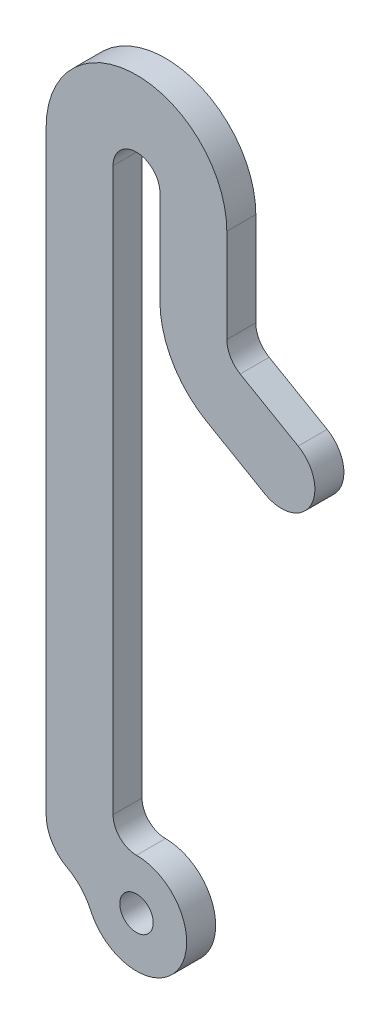
ISO-10303-21;
HEADER;
FILE_DESCRIPTION(('STEP AP214'),'2;1');
FILE_NAME('part.step','',(''),(''),'','','');
FILE_SCHEMA(('AUTOMOTIVE_DESIGN { 1 0 10303 214 1 1 1 1 }'));
ENDSEC;
DATA;
#1=APPLICATION_CONTEXT('core data for automotive mechanical design processes');
#2=APPLICATION_PROTOCOL_DEFINITION('international standard','automotive_design',2000,#1);
#3=PRODUCT_CONTEXT('',#1,'mechanical');
#4=PRODUCT('Part','Part','',(#3));
#5=PRODUCT_RELATED_PRODUCT_CATEGORY('part','',(#4));
#6=PRODUCT_DEFINITION_FORMATION('','',#4);
#7=PRODUCT_DEFINITION_CONTEXT('part definition',#1,'design');
#8=PRODUCT_DEFINITION('design','',#6,#7);
#9=PRODUCT_DEFINITION_SHAPE('','',#8);
#10=(LENGTH_UNIT() NAMED_UNIT(*) SI_UNIT(.MILLI.,.METRE.));
#11=(NAMED_UNIT(*) PLANE_ANGLE_UNIT() SI_UNIT($,.RADIAN.));
#12=(NAMED_UNIT(*) SI_UNIT($,.STERADIAN.) SOLID_ANGLE_UNIT());
#13=UNCERTAINTY_MEASURE_WITH_UNIT(LENGTH_MEASURE(1.E-05),#10,'distance_accuracy_value','');
#14=(GEOMETRIC_REPRESENTATION_CONTEXT(3) GLOBAL_UNCERTAINTY_ASSIGNED_CONTEXT((#13)) GLOBAL_UNIT_ASSIGNED_CONTEXT((#10,
#11,#12)) REPRESENTATION_CONTEXT('',''));
#15=CARTESIAN_POINT('',(0.,0.,0.));
#16=DIRECTION('',(0.,0.,1.));
#17=DIRECTION('',(1.,0.,0.));
#18=AXIS2_PLACEMENT_3D('',#15,#16,#17);
#19=CARTESIAN_POINT('',(0.,0.,5.503333164));
#20=DIRECTION('',(0.,0.,1.));
#21=DIRECTION('',(1.,0.,0.));
#22=AXIS2_PLACEMENT_3D('',#19,#20,#21);
#23=PLANE('',#22);
#24=CARTESIAN_POINT('',(0.,0.,5.503333164));
#25=DIRECTION('',(0.,0.,1.));
#26=DIRECTION('',(1.,0.,0.));
#27=AXIS2_PLACEMENT_3D('',#24,#25,#26);
#28=CIRCLE('',#27,3.175);
#29=CARTESIAN_POINT('',(3.175,0.,5.503333164));
#30=VERTEX_POINT('',#29);
#31=EDGE_CURVE('E46',#30,#30,#28,.T.);
#32=ORIENTED_EDGE('',*,*,#31,.T.);
#33=EDGE_LOOP('',(#32));
#34=FACE_BOUND('',#33,.T.);
#35=CARTESIAN_POINT('',(0.,0.,5.503333164));
#36=DIRECTION('',(0.,0.,1.));
#37=DIRECTION('',(1.,0.,0.));
#38=AXIS2_PLACEMENT_3D('',#35,#36,#37);
#39=CIRCLE('',#38,9.525);
#40=CARTESIAN_POINT('',(-8.69790974925393,-3.88226621882548,5.503333164));
#41=VERTEX_POINT('',#40);
#42=CARTESIAN_POINT('',(0.,9.525,5.503333164));
#43=VERTEX_POINT('',#42);
#44=EDGE_CURVE('E154',#41,#43,#39,.T.);
#45=ORIENTED_EDGE('',*,*,#44,.F.);
#46=CARTESIAN_POINT('',(-17.9756801484581,-8.02335018557265,5.503333164));
#47=DIRECTION('',(0.,0.,1.));
#48=DIRECTION('',(1.,0.,0.));
#49=AXIS2_PLACEMENT_3D('',#46,#47,#48);
#50=CIRCLE('',#49,10.16);
#51=CARTESIAN_POINT('',(-13.1467200636249,0.915707063326008,5.503333164));
#52=VERTEX_POINT('',#51);
#53=EDGE_CURVE('E157',#52,#41,#50,.F.);
#54=ORIENTED_EDGE('',*,*,#53,.F.);
#55=CARTESIAN_POINT('',(-9.525,7.61999999999999,5.503333164));
#56=DIRECTION('',(0.,0.,1.));
#57=DIRECTION('',(1.,0.,0.));
#58=AXIS2_PLACEMENT_3D('',#55,#56,#57);
#59=CIRCLE('',#58,7.61999999999999);
#60=CARTESIAN_POINT('',(-17.145,7.61999999999999,5.503333164));
#61=VERTEX_POINT('',#60);
#62=EDGE_CURVE('E147',#61,#52,#59,.T.);
#63=ORIENTED_EDGE('',*,*,#62,.F.);
#64=DIRECTION('',(0.,-1.,0.));
#65=VECTOR('',#64,1.);
#66=CARTESIAN_POINT('',(-17.145,120.65,5.503333164));
#67=LINE('',#66,#65);
#68=CARTESIAN_POINT('',(-17.145,120.65,5.503333164));
#69=VERTEX_POINT('',#68);
#70=EDGE_CURVE('E168',#69,#61,#67,.T.);
#71=ORIENTED_EDGE('',*,*,#70,.F.);
#72=CARTESIAN_POINT('',(0.,120.65,5.503333164));
#73=DIRECTION('',(0.,0.,1.));
#74=DIRECTION('',(1.,0.,0.));
#75=AXIS2_PLACEMENT_3D('',#72,#73,#74);
#76=CIRCLE('',#75,17.145);
#77=CARTESIAN_POINT('',(17.145,120.65,5.503333164));
#78=VERTEX_POINT('',#77);
#79=EDGE_CURVE('E170',#78,#69,#76,.T.);
#80=ORIENTED_EDGE('',*,*,#79,.F.);
#81=DIRECTION('',(0.,1.,0.));
#82=VECTOR('',#81,1.);
#83=CARTESIAN_POINT('',(17.145,120.65,5.503333164));
#84=LINE('',#83,#82);
#85=CARTESIAN_POINT('',(17.145,102.87,5.503333164));
#86=VERTEX_POINT('',#85);
#87=EDGE_CURVE('E172',#86,#78,#84,.T.);
#88=ORIENTED_EDGE('',*,*,#87,.F.);
#89=CARTESIAN_POINT('',(22.225,102.87,5.503333164));
#90=DIRECTION('',(0.,0.,1.));
#91=DIRECTION('',(1.,0.,0.));
#92=AXIS2_PLACEMENT_3D('',#89,#90,#91);
#93=CIRCLE('',#92,5.08);
#94=CARTESIAN_POINT('',(19.685,98.470590948775,5.503333164));
#95=VERTEX_POINT('',#94);
#96=EDGE_CURVE('E174',#95,#86,#93,.F.);
#97=ORIENTED_EDGE('',*,*,#96,.F.);
#98=DIRECTION('',(-0.86602540378444,0.499999999999997,0.));
#99=VECTOR('',#98,1.);
#100=CARTESIAN_POINT('',(19.685,98.470590948775,5.503333164));
#101=LINE('',#100,#99);
#102=CARTESIAN_POINT('',(30.6835226280626,92.1205909487749,5.503333164));
#103=VERTEX_POINT('',#102);
#104=EDGE_CURVE('E176',#103,#95,#101,.T.);
#105=ORIENTED_EDGE('',*,*,#104,.F.);
#106=CARTESIAN_POINT('',(27.5085226280626,86.6213296347437,5.503333164));
#107=DIRECTION('',(0.,0.,1.));
#108=DIRECTION('',(1.,0.,0.));
#109=AXIS2_PLACEMENT_3D('',#106,#107,#108);
#110=CIRCLE('',#109,6.34999999999999);
#111=CARTESIAN_POINT('',(24.3335226280625,81.1220683207127,5.503333164));
#112=VERTEX_POINT('',#111);
#113=EDGE_CURVE('E178',#112,#103,#110,.T.);
#114=ORIENTED_EDGE('',*,*,#113,.F.);
#115=DIRECTION('',(0.86602540378444,-0.499999999999997,0.));
#116=VECTOR('',#115,1.);
#117=CARTESIAN_POINT('',(24.3335226280625,81.1220683207127,5.503333164));
#118=LINE('',#117,#116);
#119=CARTESIAN_POINT('',(13.335,87.4720683207127,5.503333164));
#120=VERTEX_POINT('',#119);
#121=EDGE_CURVE('E180',#120,#112,#118,.T.);
#122=ORIENTED_EDGE('',*,*,#121,.F.);
#123=CARTESIAN_POINT('',(22.225,102.87,5.503333164));
#124=DIRECTION('',(0.,0.,1.));
#125=DIRECTION('',(1.,0.,0.));
#126=AXIS2_PLACEMENT_3D('',#123,#124,#125);
#127=CIRCLE('',#126,17.78);
#128=CARTESIAN_POINT('',(4.445,102.87,5.503333164));
#129=VERTEX_POINT('',#128);
#130=EDGE_CURVE('E182',#129,#120,#127,.T.);
#131=ORIENTED_EDGE('',*,*,#130,.F.);
#132=DIRECTION('',(0.,-1.,0.));
#133=VECTOR('',#132,1.);
#134=CARTESIAN_POINT('',(4.445,120.65,5.503333164));
#135=LINE('',#134,#133);
#136=CARTESIAN_POINT('',(4.445,120.65,5.503333164));
#137=VERTEX_POINT('',#136);
#138=EDGE_CURVE('E184',#137,#129,#135,.T.);
#139=ORIENTED_EDGE('',*,*,#138,.F.);
#140=CARTESIAN_POINT('',(0.,120.65,5.503333164));
#141=DIRECTION('',(0.,0.,1.));
#142=DIRECTION('',(1.,0.,0.));
#143=AXIS2_PLACEMENT_3D('',#140,#141,#142);
#144=CIRCLE('',#143,4.445);
#145=CARTESIAN_POINT('',(-4.445,120.65,5.503333164));
#146=VERTEX_POINT('',#145);
#147=EDGE_CURVE('E186',#146,#137,#144,.F.);
#148=ORIENTED_EDGE('',*,*,#147,.F.);
#149=DIRECTION('',(0.,1.,0.));
#150=VECTOR('',#149,1.);
#151=CARTESIAN_POINT('',(-4.445,120.65,5.503333164));
#152=LINE('',#151,#150);
#153=CARTESIAN_POINT('',(-4.445,13.97,5.503333164));
#154=VERTEX_POINT('',#153);
#155=EDGE_CURVE('E188',#154,#146,#152,.T.);
#156=ORIENTED_EDGE('',*,*,#155,.F.);
#157=CARTESIAN_POINT('',(0.,13.97,5.503333164));
#158=DIRECTION('',(0.,0.,1.));
#159=DIRECTION('',(1.,0.,0.));
#160=AXIS2_PLACEMENT_3D('',#157,#158,#159);
#161=CIRCLE('',#160,4.445);
#162=EDGE_CURVE('E166',#43,#154,#161,.F.);
#163=ORIENTED_EDGE('',*,*,#162,.F.);
#164=EDGE_LOOP('',(#45,#54,#63,#71,#80,#88,#97,#105,#114,#122,#131,#139,#148,#156,#163));
#165=FACE_BOUND('',#164,.T.);
#166=ADVANCED_FACE('F38',(#34,#165),#23,.F.);
#167=CARTESIAN_POINT('',(0.,0.,11.006666582));
#168=DIRECTION('',(0.,0.,1.));
#169=DIRECTION('',(1.,0.,0.));
#170=AXIS2_PLACEMENT_3D('',#167,#168,#169);
#171=PLANE('',#170);
#172=CARTESIAN_POINT('',(0.,0.,11.006666582));
#173=DIRECTION('',(0.,0.,1.));
#174=DIRECTION('',(1.,0.,0.));
#175=AXIS2_PLACEMENT_3D('',#172,#173,#174);
#176=CIRCLE('',#175,9.525);
#177=CARTESIAN_POINT('',(-8.69790974925393,-3.88226621882548,11.006666582));
#178=VERTEX_POINT('',#177);
#179=CARTESIAN_POINT('',(0.,9.525,11.006666582));
#180=VERTEX_POINT('',#179);
#181=EDGE_CURVE('E194',#178,#180,#176,.T.);
#182=ORIENTED_EDGE('',*,*,#181,.T.);
#183=CARTESIAN_POINT('',(0.,13.97,11.006666582));
#184=DIRECTION('',(0.,0.,1.));
#185=DIRECTION('',(1.,0.,0.));
#186=AXIS2_PLACEMENT_3D('',#183,#184,#185);
#187=CIRCLE('',#186,4.445);
#188=CARTESIAN_POINT('',(-4.445,13.97,11.006666582));
#189=VERTEX_POINT('',#188);
#190=EDGE_CURVE('E197',#180,#189,#187,.F.);
#191=ORIENTED_EDGE('',*,*,#190,.T.);
#192=DIRECTION('',(0.,1.,0.));
#193=VECTOR('',#192,1.);
#194=CARTESIAN_POINT('',(-4.445,120.65,11.006666582));
#195=LINE('',#194,#193);
#196=CARTESIAN_POINT('',(-4.445,120.65,11.006666582));
#197=VERTEX_POINT('',#196);
#198=EDGE_CURVE('E228',#189,#197,#195,.T.);
#199=ORIENTED_EDGE('',*,*,#198,.T.);
#200=CARTESIAN_POINT('',(0.,120.65,11.006666582));
#201=DIRECTION('',(0.,0.,1.));
#202=DIRECTION('',(1.,0.,0.));
#203=AXIS2_PLACEMENT_3D('',#200,#201,#202);
#204=CIRCLE('',#203,4.445);
#205=CARTESIAN_POINT('',(4.445,120.65,11.006666582));
#206=VERTEX_POINT('',#205);
#207=EDGE_CURVE('E225',#197,#206,#204,.F.);
#208=ORIENTED_EDGE('',*,*,#207,.T.);
#209=DIRECTION('',(0.,-1.,0.));
#210=VECTOR('',#209,1.);
#211=CARTESIAN_POINT('',(4.445,120.65,11.006666582));
#212=LINE('',#211,#210);
#213=CARTESIAN_POINT('',(4.445,102.87,11.006666582));
#214=VERTEX_POINT('',#213);
#215=EDGE_CURVE('E222',#206,#214,#212,.T.);
#216=ORIENTED_EDGE('',*,*,#215,.T.);
#217=CARTESIAN_POINT('',(22.225,102.87,11.006666582));
#218=DIRECTION('',(0.,0.,1.));
#219=DIRECTION('',(1.,0.,0.));
#220=AXIS2_PLACEMENT_3D('',#217,#218,#219);
#221=CIRCLE('',#220,17.78);
#222=CARTESIAN_POINT('',(13.335,87.4720683207127,11.006666582));
#223=VERTEX_POINT('',#222);
#224=EDGE_CURVE('E219',#214,#223,#221,.T.);
#225=ORIENTED_EDGE('',*,*,#224,.T.);
#226=DIRECTION('',(0.86602540378444,-0.499999999999997,0.));
#227=VECTOR('',#226,1.);
#228=CARTESIAN_POINT('',(24.3335226280625,81.1220683207127,11.006666582));
#229=LINE('',#228,#227);
#230=CARTESIAN_POINT('',(24.3335226280625,81.1220683207127,11.006666582));
#231=VERTEX_POINT('',#230);
#232=EDGE_CURVE('E216',#223,#231,#229,.T.);
#233=ORIENTED_EDGE('',*,*,#232,.T.);
#234=CARTESIAN_POINT('',(27.5085226280626,86.6213296347437,11.006666582));
#235=DIRECTION('',(0.,0.,1.));
#236=DIRECTION('',(1.,0.,0.));
#237=AXIS2_PLACEMENT_3D('',#234,#235,#236);
#238=CIRCLE('',#237,6.34999999999999);
#239=CARTESIAN_POINT('',(30.6835226280626,92.1205909487749,11.006666582));
#240=VERTEX_POINT('',#239);
#241=EDGE_CURVE('E213',#231,#240,#238,.T.);
#242=ORIENTED_EDGE('',*,*,#241,.T.);
#243=DIRECTION('',(-0.86602540378444,0.499999999999997,0.));
#244=VECTOR('',#243,1.);
#245=CARTESIAN_POINT('',(19.685,98.470590948775,11.006666582));
#246=LINE('',#245,#244);
#247=CARTESIAN_POINT('',(19.685,98.470590948775,11.006666582));
#248=VERTEX_POINT('',#247);
#249=EDGE_CURVE('E210',#240,#248,#246,.T.);
#250=ORIENTED_EDGE('',*,*,#249,.T.);
#251=CARTESIAN_POINT('',(22.225,102.87,11.006666582));
#252=DIRECTION('',(0.,0.,1.));
#253=DIRECTION('',(1.,0.,0.));
#254=AXIS2_PLACEMENT_3D('',#251,#252,#253);
#255=CIRCLE('',#254,5.08);
#256=CARTESIAN_POINT('',(17.145,102.87,11.006666582));
#257=VERTEX_POINT('',#256);
#258=EDGE_CURVE('E207',#248,#257,#255,.F.);
#259=ORIENTED_EDGE('',*,*,#258,.T.);
#260=DIRECTION('',(0.,1.,0.));
#261=VECTOR('',#260,1.);
#262=CARTESIAN_POINT('',(17.145,120.65,11.006666582));
#263=LINE('',#262,#261);
#264=CARTESIAN_POINT('',(17.145,120.65,11.006666582));
#265=VERTEX_POINT('',#264);
#266=EDGE_CURVE('E204',#257,#265,#263,.T.);
#267=ORIENTED_EDGE('',*,*,#266,.T.);
#268=CARTESIAN_POINT('',(0.,120.65,11.006666582));
#269=DIRECTION('',(0.,0.,1.));
#270=DIRECTION('',(1.,0.,0.));
#271=AXIS2_PLACEMENT_3D('',#268,#269,#270);
#272=CIRCLE('',#271,17.145);
#273=CARTESIAN_POINT('',(-17.145,120.65,11.006666582));
#274=VERTEX_POINT('',#273);
#275=EDGE_CURVE('E201',#265,#274,#272,.T.);
#276=ORIENTED_EDGE('',*,*,#275,.T.);
#277=DIRECTION('',(0.,-1.,0.));
#278=VECTOR('',#277,1.);
#279=CARTESIAN_POINT('',(-17.145,120.65,11.006666582));
#280=LINE('',#279,#278);
#281=CARTESIAN_POINT('',(-17.145,7.61999999999999,11.006666582));
#282=VERTEX_POINT('',#281);
#283=EDGE_CURVE('E193',#274,#282,#280,.T.);
#284=ORIENTED_EDGE('',*,*,#283,.T.);
#285=CARTESIAN_POINT('',(-9.525,7.61999999999999,11.006666582));
#286=DIRECTION('',(0.,0.,1.));
#287=DIRECTION('',(1.,0.,0.));
#288=AXIS2_PLACEMENT_3D('',#285,#286,#287);
#289=CIRCLE('',#288,7.61999999999999);
#290=CARTESIAN_POINT('',(-13.1467200636249,0.915707063326008,11.006666582));
#291=VERTEX_POINT('',#290);
#292=EDGE_CURVE('E153',#282,#291,#289,.T.);
#293=ORIENTED_EDGE('',*,*,#292,.T.);
#294=CARTESIAN_POINT('',(-17.9756801484581,-8.02335018557265,11.006666582));
#295=DIRECTION('',(0.,0.,1.));
#296=DIRECTION('',(1.,0.,0.));
#297=AXIS2_PLACEMENT_3D('',#294,#295,#296);
#298=CIRCLE('',#297,10.16);
#299=EDGE_CURVE('E11',#291,#178,#298,.F.);
#300=ORIENTED_EDGE('',*,*,#299,.T.);
#301=EDGE_LOOP('',(#182,#191,#199,#208,#216,#225,#233,#242,#250,#259,#267,#276,#284,#293,#300));
#302=FACE_BOUND('',#301,.T.);
#303=CARTESIAN_POINT('',(0.,0.,11.006666582));
#304=DIRECTION('',(0.,0.,1.));
#305=DIRECTION('',(1.,0.,0.));
#306=AXIS2_PLACEMENT_3D('',#303,#304,#305);
#307=CIRCLE('',#306,3.175);
#308=CARTESIAN_POINT('',(3.175,0.,11.006666582));
#309=VERTEX_POINT('',#308);
#310=EDGE_CURVE('E41',#309,#309,#307,.T.);
#311=ORIENTED_EDGE('',*,*,#310,.F.);
#312=EDGE_LOOP('',(#311));
#313=FACE_BOUND('',#312,.T.);
#314=ADVANCED_FACE('F234',(#302,#313),#171,.T.);
#315=CARTESIAN_POINT('',(0.,13.97,16.51));
#316=DIRECTION('',(0.,0.,-1.));
#317=DIRECTION('',(-1.,0.,0.));
#318=AXIS2_PLACEMENT_3D('',#315,#316,#317);
#319=CYLINDRICAL_SURFACE('',#318,4.445);
#320=ORIENTED_EDGE('',*,*,#190,.F.);
#321=DIRECTION('',(0.,0.,-1.));
#322=VECTOR('',#321,1.);
#323=CARTESIAN_POINT('',(0.,9.525,16.51));
#324=LINE('',#323,#322);
#325=EDGE_CURVE('E162',#180,#43,#324,.T.);
#326=ORIENTED_EDGE('',*,*,#325,.T.);
#327=ORIENTED_EDGE('',*,*,#162,.T.);
#328=DIRECTION('',(0.,0.,-1.));
#329=VECTOR('',#328,1.);
#330=CARTESIAN_POINT('',(-4.445,13.97,16.51));
#331=LINE('',#330,#329);
#332=EDGE_CURVE('E242',#189,#154,#331,.T.);
#333=ORIENTED_EDGE('',*,*,#332,.F.);
#334=EDGE_LOOP('',(#320,#326,#327,#333));
#335=FACE_BOUND('',#334,.T.);
#336=ADVANCED_FACE('F255',(#335),#319,.F.);
#337=CARTESIAN_POINT('',(-4.445,120.65,16.51));
#338=DIRECTION('',(-1.,0.,0.));
#339=DIRECTION('',(0.,0.,1.));
#340=AXIS2_PLACEMENT_3D('',#337,#338,#339);
#341=PLANE('',#340);
#342=ORIENTED_EDGE('',*,*,#198,.F.);
#343=ORIENTED_EDGE('',*,*,#332,.T.);
#344=ORIENTED_EDGE('',*,*,#155,.T.);
#345=DIRECTION('',(0.,0.,-1.));
#346=VECTOR('',#345,1.);
#347=CARTESIAN_POINT('',(-4.445,120.65,16.51));
#348=LINE('',#347,#346);
#349=EDGE_CURVE('E244',#197,#146,#348,.T.);
#350=ORIENTED_EDGE('',*,*,#349,.F.);
#351=EDGE_LOOP('',(#342,#343,#344,#350));
#352=FACE_BOUND('',#351,.T.);
#353=ADVANCED_FACE('F241',(#352),#341,.F.);
#354=CARTESIAN_POINT('',(0.,120.65,16.51));
#355=DIRECTION('',(0.,0.,-1.));
#356=DIRECTION('',(-1.,0.,0.));
#357=AXIS2_PLACEMENT_3D('',#354,#355,#356);
#358=CYLINDRICAL_SURFACE('',#357,4.445);
#359=ORIENTED_EDGE('',*,*,#207,.F.);
#360=ORIENTED_EDGE('',*,*,#349,.T.);
#361=ORIENTED_EDGE('',*,*,#147,.T.);
#362=DIRECTION('',(0.,0.,-1.));
#363=VECTOR('',#362,1.);
#364=CARTESIAN_POINT('',(4.445,120.65,16.51));
#365=LINE('',#364,#363);
#366=EDGE_CURVE('E248',#206,#137,#365,.T.);
#367=ORIENTED_EDGE('',*,*,#366,.F.);
#368=EDGE_LOOP('',(#359,#360,#361,#367));
#369=FACE_BOUND('',#368,.T.);
#370=ADVANCED_FACE('F295',(#369),#358,.F.);
#371=CARTESIAN_POINT('',(4.445,120.65,16.51));
#372=DIRECTION('',(1.,0.,0.));
#373=DIRECTION('',(0.,1.,0.));
#374=AXIS2_PLACEMENT_3D('',#371,#372,#373);
#375=PLANE('',#374);
#376=ORIENTED_EDGE('',*,*,#215,.F.);
#377=ORIENTED_EDGE('',*,*,#366,.T.);
#378=ORIENTED_EDGE('',*,*,#138,.T.);
#379=DIRECTION('',(0.,0.,-1.));
#380=VECTOR('',#379,1.);
#381=CARTESIAN_POINT('',(4.445,102.87,16.51));
#382=LINE('',#381,#380);
#383=EDGE_CURVE('E252',#214,#129,#382,.T.);
#384=ORIENTED_EDGE('',*,*,#383,.F.);
#385=EDGE_LOOP('',(#376,#377,#378,#384));
#386=FACE_BOUND('',#385,.T.);
#387=ADVANCED_FACE('F292',(#386),#375,.F.);
#388=CARTESIAN_POINT('',(22.225,102.87,16.51));
#389=DIRECTION('',(0.,0.,-1.));
#390=DIRECTION('',(-1.,0.,0.));
#391=AXIS2_PLACEMENT_3D('',#388,#389,#390);
#392=CYLINDRICAL_SURFACE('',#391,17.78);
#393=ORIENTED_EDGE('',*,*,#224,.F.);
#394=ORIENTED_EDGE('',*,*,#383,.T.);
#395=ORIENTED_EDGE('',*,*,#130,.T.);
#396=DIRECTION('',(0.,0.,-1.));
#397=VECTOR('',#396,1.);
#398=CARTESIAN_POINT('',(13.335,87.4720683207127,16.51));
#399=LINE('',#398,#397);
#400=EDGE_CURVE('E282',#223,#120,#399,.T.);
#401=ORIENTED_EDGE('',*,*,#400,.F.);
#402=EDGE_LOOP('',(#393,#394,#395,#401));
#403=FACE_BOUND('',#402,.T.);
#404=ADVANCED_FACE('F287',(#403),#392,.T.);
#405=CARTESIAN_POINT('',(24.3335226280625,81.1220683207127,16.51));
#406=DIRECTION('',(0.499999999999997,0.86602540378444,0.));
#407=DIRECTION('',(-0.86602540378444,0.499999999999997,0.));
#408=AXIS2_PLACEMENT_3D('',#405,#406,#407);
#409=PLANE('',#408);
#410=ORIENTED_EDGE('',*,*,#232,.F.);
#411=ORIENTED_EDGE('',*,*,#400,.T.);
#412=ORIENTED_EDGE('',*,*,#121,.T.);
#413=DIRECTION('',(0.,0.,-1.));
#414=VECTOR('',#413,1.);
#415=CARTESIAN_POINT('',(24.3335226280625,81.1220683207127,16.51));
#416=LINE('',#415,#414);
#417=EDGE_CURVE('E279',#231,#112,#416,.T.);
#418=ORIENTED_EDGE('',*,*,#417,.F.);
#419=EDGE_LOOP('',(#410,#411,#412,#418));
#420=FACE_BOUND('',#419,.T.);
#421=ADVANCED_FACE('F299',(#420),#409,.F.);
#422=CARTESIAN_POINT('',(27.5085226280626,86.6213296347437,16.51));
#423=DIRECTION('',(0.,0.,-1.));
#424=DIRECTION('',(-1.,0.,0.));
#425=AXIS2_PLACEMENT_3D('',#422,#423,#424);
#426=CYLINDRICAL_SURFACE('',#425,6.34999999999999);
#427=ORIENTED_EDGE('',*,*,#241,.F.);
#428=ORIENTED_EDGE('',*,*,#417,.T.);
#429=ORIENTED_EDGE('',*,*,#113,.T.);
#430=DIRECTION('',(0.,0.,-1.));
#431=VECTOR('',#430,1.);
#432=CARTESIAN_POINT('',(30.6835226280626,92.1205909487749,16.51));
#433=LINE('',#432,#431);
#434=EDGE_CURVE('E276',#240,#103,#433,.T.);
#435=ORIENTED_EDGE('',*,*,#434,.F.);
#436=EDGE_LOOP('',(#427,#428,#429,#435));
#437=FACE_BOUND('',#436,.T.);
#438=ADVANCED_FACE('F303',(#437),#426,.T.);
#439=CARTESIAN_POINT('',(19.685,98.470590948775,16.51));
#440=DIRECTION('',(-0.499999999999997,-0.86602540378444,0.));
#441=DIRECTION('',(0.86602540378444,-0.499999999999997,0.));
#442=AXIS2_PLACEMENT_3D('',#439,#440,#441);
#443=PLANE('',#442);
#444=ORIENTED_EDGE('',*,*,#249,.F.);
#445=ORIENTED_EDGE('',*,*,#434,.T.);
#446=ORIENTED_EDGE('',*,*,#104,.T.);
#447=DIRECTION('',(0.,0.,-1.));
#448=VECTOR('',#447,1.);
#449=CARTESIAN_POINT('',(19.685,98.470590948775,16.51));
#450=LINE('',#449,#448);
#451=EDGE_CURVE('E273',#248,#95,#450,.T.);
#452=ORIENTED_EDGE('',*,*,#451,.F.);
#453=EDGE_LOOP('',(#444,#445,#446,#452));
#454=FACE_BOUND('',#453,.T.);
#455=ADVANCED_FACE('F305',(#454),#443,.F.);
#456=CARTESIAN_POINT('',(22.225,102.87,16.51));
#457=DIRECTION('',(0.,0.,-1.));
#458=DIRECTION('',(-1.,0.,0.));
#459=AXIS2_PLACEMENT_3D('',#456,#457,#458);
#460=CYLINDRICAL_SURFACE('',#459,5.08);
#461=ORIENTED_EDGE('',*,*,#258,.F.);
#462=ORIENTED_EDGE('',*,*,#451,.T.);
#463=ORIENTED_EDGE('',*,*,#96,.T.);
#464=DIRECTION('',(0.,0.,-1.));
#465=VECTOR('',#464,1.);
#466=CARTESIAN_POINT('',(17.145,102.87,16.51));
#467=LINE('',#466,#465);
#468=EDGE_CURVE('E270',#257,#86,#467,.T.);
#469=ORIENTED_EDGE('',*,*,#468,.F.);
#470=EDGE_LOOP('',(#461,#462,#463,#469));
#471=FACE_BOUND('',#470,.T.);
#472=ADVANCED_FACE('F310',(#471),#460,.F.);
#473=CARTESIAN_POINT('',(17.145,120.65,16.51));
#474=DIRECTION('',(-1.,0.,0.));
#475=DIRECTION('',(0.,-1.,0.));
#476=AXIS2_PLACEMENT_3D('',#473,#474,#475);
#477=PLANE('',#476);
#478=ORIENTED_EDGE('',*,*,#266,.F.);
#479=ORIENTED_EDGE('',*,*,#468,.T.);
#480=ORIENTED_EDGE('',*,*,#87,.T.);
#481=DIRECTION('',(0.,0.,-1.));
#482=VECTOR('',#481,1.);
#483=CARTESIAN_POINT('',(17.145,120.65,16.51));
#484=LINE('',#483,#482);
#485=EDGE_CURVE('E265',#265,#78,#484,.T.);
#486=ORIENTED_EDGE('',*,*,#485,.F.);
#487=EDGE_LOOP('',(#478,#479,#480,#486));
#488=FACE_BOUND('',#487,.T.);
#489=ADVANCED_FACE('F313',(#488),#477,.F.);
#490=CARTESIAN_POINT('',(0.,0.,16.51));
#491=DIRECTION('',(0.,0.,-1.));
#492=DIRECTION('',(-1.,0.,0.));
#493=AXIS2_PLACEMENT_3D('',#490,#491,#492);
#494=CYLINDRICAL_SURFACE('',#493,9.525);
#495=ORIENTED_EDGE('',*,*,#181,.F.);
#496=DIRECTION('',(0.,0.,-1.));
#497=VECTOR('',#496,1.);
#498=CARTESIAN_POINT('',(-8.69790974925393,-3.88226621882548,16.51));
#499=LINE('',#498,#497);
#500=EDGE_CURVE('E62',#178,#41,#499,.T.);
#501=ORIENTED_EDGE('',*,*,#500,.T.);
#502=ORIENTED_EDGE('',*,*,#44,.T.);
#503=ORIENTED_EDGE('',*,*,#325,.F.);
#504=EDGE_LOOP('',(#495,#501,#502,#503));
#505=FACE_BOUND('',#504,.T.);
#506=ADVANCED_FACE('F257',(#505),#494,.T.);
#507=CARTESIAN_POINT('',(-9.525,7.61999999999999,16.51));
#508=DIRECTION('',(0.,0.,-1.));
#509=DIRECTION('',(-1.,0.,0.));
#510=AXIS2_PLACEMENT_3D('',#507,#508,#509);
#511=CYLINDRICAL_SURFACE('',#510,7.61999999999999);
#512=ORIENTED_EDGE('',*,*,#292,.F.);
#513=DIRECTION('',(0.,0.,-1.));
#514=VECTOR('',#513,1.);
#515=CARTESIAN_POINT('',(-17.145,7.61999999999999,16.51));
#516=LINE('',#515,#514);
#517=EDGE_CURVE('E150',#282,#61,#516,.T.);
#518=ORIENTED_EDGE('',*,*,#517,.T.);
#519=ORIENTED_EDGE('',*,*,#62,.T.);
#520=DIRECTION('',(0.,0.,-1.));
#521=VECTOR('',#520,1.);
#522=CARTESIAN_POINT('',(-13.1467200636249,0.915707063326008,16.51));
#523=LINE('',#522,#521);
#524=EDGE_CURVE('E54',#52,#291,#523,.F.);
#525=ORIENTED_EDGE('',*,*,#524,.T.);
#526=EDGE_LOOP('',(#512,#518,#519,#525));
#527=FACE_BOUND('',#526,.T.);
#528=ADVANCED_FACE('F149',(#527),#511,.T.);
#529=CARTESIAN_POINT('',(-17.9756801484581,-8.02335018557265,16.51));
#530=DIRECTION('',(0.,0.,1.));
#531=DIRECTION('',(1.,0.,0.));
#532=AXIS2_PLACEMENT_3D('',#529,#530,#531);
#533=CYLINDRICAL_SURFACE('',#532,10.16);
#534=ORIENTED_EDGE('',*,*,#299,.F.);
#535=ORIENTED_EDGE('',*,*,#524,.F.);
#536=ORIENTED_EDGE('',*,*,#53,.T.);
#537=ORIENTED_EDGE('',*,*,#500,.F.);
#538=EDGE_LOOP('',(#534,#535,#536,#537));
#539=FACE_BOUND('',#538,.T.);
#540=ADVANCED_FACE('F160',(#539),#533,.F.);
#541=CARTESIAN_POINT('',(0.,120.65,16.51));
#542=DIRECTION('',(0.,0.,-1.));
#543=DIRECTION('',(-1.,0.,0.));
#544=AXIS2_PLACEMENT_3D('',#541,#542,#543);
#545=CYLINDRICAL_SURFACE('',#544,17.145);
#546=ORIENTED_EDGE('',*,*,#275,.F.);
#547=ORIENTED_EDGE('',*,*,#485,.T.);
#548=ORIENTED_EDGE('',*,*,#79,.T.);
#549=DIRECTION('',(0.,0.,-1.));
#550=VECTOR('',#549,1.);
#551=CARTESIAN_POINT('',(-17.145,120.65,16.51));
#552=LINE('',#551,#550);
#553=EDGE_CURVE('E263',#274,#69,#552,.T.);
#554=ORIENTED_EDGE('',*,*,#553,.F.);
#555=EDGE_LOOP('',(#546,#547,#548,#554));
#556=FACE_BOUND('',#555,.T.);
#557=ADVANCED_FACE('F316',(#556),#545,.T.);
#558=CARTESIAN_POINT('',(-17.145,120.65,16.51));
#559=DIRECTION('',(1.,0.,0.));
#560=DIRECTION('',(0.,1.,0.));
#561=AXIS2_PLACEMENT_3D('',#558,#559,#560);
#562=PLANE('',#561);
#563=ORIENTED_EDGE('',*,*,#283,.F.);
#564=ORIENTED_EDGE('',*,*,#553,.T.);
#565=ORIENTED_EDGE('',*,*,#70,.T.);
#566=ORIENTED_EDGE('',*,*,#517,.F.);
#567=EDGE_LOOP('',(#563,#564,#565,#566));
#568=FACE_BOUND('',#567,.T.);
#569=ADVANCED_FACE('F262',(#568),#562,.F.);
#570=CARTESIAN_POINT('',(0.,0.,16.51));
#571=DIRECTION('',(0.,0.,-1.));
#572=DIRECTION('',(-1.,0.,0.));
#573=AXIS2_PLACEMENT_3D('',#570,#571,#572);
#574=CYLINDRICAL_SURFACE('',#573,3.175);
#575=ORIENTED_EDGE('',*,*,#31,.F.);
#576=EDGE_LOOP('',(#575));
#577=FACE_BOUND('',#576,.T.);
#578=ORIENTED_EDGE('',*,*,#310,.T.);
#579=EDGE_LOOP('',(#578));
#580=FACE_BOUND('',#579,.T.);
#581=ADVANCED_FACE('F323',(#577,#580),#574,.F.);
#582=CLOSED_SHELL('',(#166,#314,#336,#353,#370,#387,#404,#421,#438,#455,#472,#489,#506,#528,
#540,#557,#569,#581));
#583=MANIFOLD_SOLID_BREP('B2',#582);
#584=ADVANCED_BREP_SHAPE_REPRESENTATION('',(#18,#583),#14);
#585=SHAPE_DEFINITION_REPRESENTATION(#9,#584);
ENDSEC;
END-ISO-10303-21;
